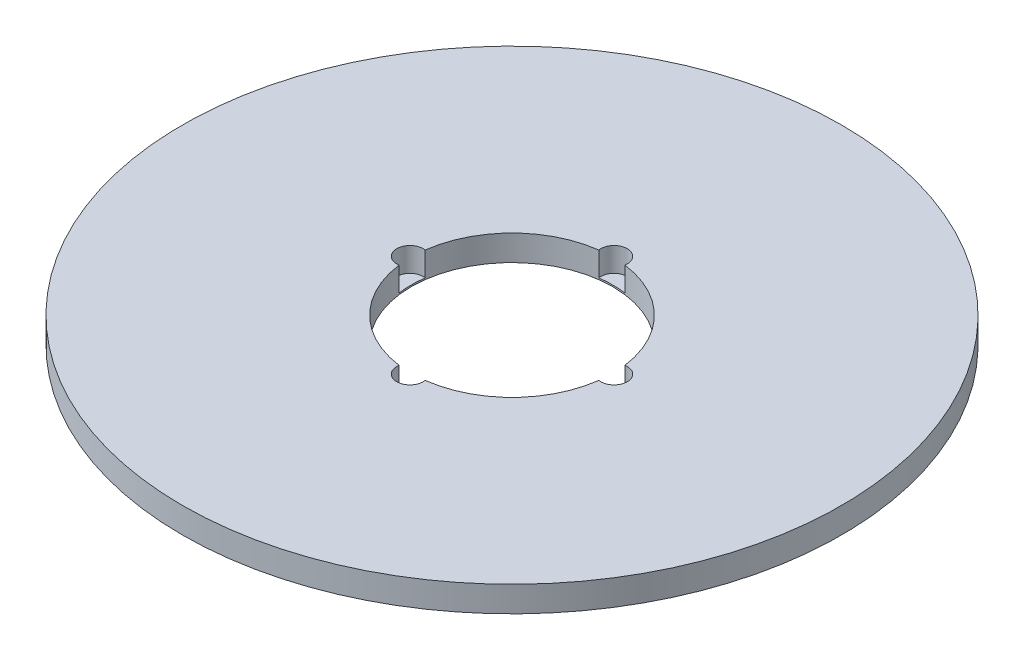
ISO-10303-21;
HEADER;
FILE_DESCRIPTION(('STEP AP214'),'2;1');
FILE_NAME('part.step','',(''),(''),'','','');
FILE_SCHEMA(('AUTOMOTIVE_DESIGN { 1 0 10303 214 1 1 1 1 }'));
ENDSEC;
DATA;
#1=APPLICATION_CONTEXT('core data for automotive mechanical design processes');
#2=APPLICATION_PROTOCOL_DEFINITION('international standard','automotive_design',2000,#1);
#3=PRODUCT_CONTEXT('',#1,'mechanical');
#4=PRODUCT('Part','Part','',(#3));
#5=PRODUCT_RELATED_PRODUCT_CATEGORY('part','',(#4));
#6=PRODUCT_DEFINITION_FORMATION('','',#4);
#7=PRODUCT_DEFINITION_CONTEXT('part definition',#1,'design');
#8=PRODUCT_DEFINITION('design','',#6,#7);
#9=PRODUCT_DEFINITION_SHAPE('','',#8);
#10=(LENGTH_UNIT() NAMED_UNIT(*) SI_UNIT(.MILLI.,.METRE.));
#11=(NAMED_UNIT(*) PLANE_ANGLE_UNIT() SI_UNIT($,.RADIAN.));
#12=(NAMED_UNIT(*) SI_UNIT($,.STERADIAN.) SOLID_ANGLE_UNIT());
#13=UNCERTAINTY_MEASURE_WITH_UNIT(LENGTH_MEASURE(1.E-05),#10,'distance_accuracy_value','');
#14=(GEOMETRIC_REPRESENTATION_CONTEXT(3) GLOBAL_UNCERTAINTY_ASSIGNED_CONTEXT((#13)) GLOBAL_UNIT_ASSIGNED_CONTEXT((#10,
#11,#12)) REPRESENTATION_CONTEXT('',''));
#15=CARTESIAN_POINT('',(0.,0.,0.));
#16=DIRECTION('',(0.,0.,1.));
#17=DIRECTION('',(1.,0.,0.));
#18=AXIS2_PLACEMENT_3D('',#15,#16,#17);
#19=CARTESIAN_POINT('',(0.,7.,0.));
#20=DIRECTION('',(0.,-1.,0.));
#21=DIRECTION('',(0.,0.,-1.));
#22=AXIS2_PLACEMENT_3D('',#19,#20,#21);
#23=CYLINDRICAL_SURFACE('',#22,90.);
#24=CARTESIAN_POINT('',(0.,7.,0.));
#25=DIRECTION('',(0.,1.,0.));
#26=DIRECTION('',(0.,0.,1.));
#27=AXIS2_PLACEMENT_3D('',#24,#25,#26);
#28=CIRCLE('',#27,90.);
#29=CARTESIAN_POINT('',(0.,7.,90.));
#30=VERTEX_POINT('',#29);
#31=EDGE_CURVE('E145',#30,#30,#28,.T.);
#32=ORIENTED_EDGE('',*,*,#31,.F.);
#33=EDGE_LOOP('',(#32));
#34=FACE_BOUND('',#33,.T.);
#35=CARTESIAN_POINT('',(0.,0.,0.));
#36=DIRECTION('',(0.,1.,0.));
#37=DIRECTION('',(0.,0.,1.));
#38=AXIS2_PLACEMENT_3D('',#35,#36,#37);
#39=CIRCLE('',#38,90.);
#40=CARTESIAN_POINT('',(0.,0.,90.));
#41=VERTEX_POINT('',#40);
#42=EDGE_CURVE('E143',#41,#41,#39,.T.);
#43=ORIENTED_EDGE('',*,*,#42,.T.);
#44=EDGE_LOOP('',(#43));
#45=FACE_BOUND('',#44,.T.);
#46=ADVANCED_FACE('F39',(#34,#45),#23,.T.);
#47=CARTESIAN_POINT('',(0.,7.,0.));
#48=DIRECTION('',(0.,1.,0.));
#49=DIRECTION('',(0.,0.,1.));
#50=AXIS2_PLACEMENT_3D('',#47,#48,#49);
#51=PLANE('',#50);
#52=CARTESIAN_POINT('',(0.,7.,27.861501837331));
#53=DIRECTION('',(0.,1.,0.));
#54=DIRECTION('',(1.,0.,0.));
#55=AXIS2_PLACEMENT_3D('',#52,#53,#54);
#56=CIRCLE('',#55,3.61404481354777);
#57=CARTESIAN_POINT('',(-3.56497036682153,7.,27.267947966132));
#58=VERTEX_POINT('',#57);
#59=CARTESIAN_POINT('',(3.56497036682172,7.,27.267947966132));
#60=VERTEX_POINT('',#59);
#61=EDGE_CURVE('E152',#58,#60,#56,.T.);
#62=ORIENTED_EDGE('',*,*,#61,.F.);
#63=CARTESIAN_POINT('',(0.,7.,0.));
#64=DIRECTION('',(0.,1.,0.));
#65=DIRECTION('',(0.,0.,1.));
#66=AXIS2_PLACEMENT_3D('',#63,#64,#65);
#67=CIRCLE('',#66,27.5);
#68=CARTESIAN_POINT('',(-27.267947966132,7.,3.56497036682162));
#69=VERTEX_POINT('',#68);
#70=EDGE_CURVE('E133',#69,#58,#67,.T.);
#71=ORIENTED_EDGE('',*,*,#70,.F.);
#72=CARTESIAN_POINT('',(-27.861501837331,7.,0.));
#73=DIRECTION('',(0.,1.,0.));
#74=DIRECTION('',(0.,0.,1.));
#75=AXIS2_PLACEMENT_3D('',#72,#73,#74);
#76=CIRCLE('',#75,3.61404481354777);
#77=CARTESIAN_POINT('',(-27.267947966132,7.,-3.56497036682162));
#78=VERTEX_POINT('',#77);
#79=EDGE_CURVE('E128',#78,#69,#76,.T.);
#80=ORIENTED_EDGE('',*,*,#79,.F.);
#81=CARTESIAN_POINT('',(-3.56497036682191,7.,-27.267947966132));
#82=VERTEX_POINT('',#81);
#83=EDGE_CURVE('E121',#82,#78,#67,.T.);
#84=ORIENTED_EDGE('',*,*,#83,.F.);
#85=CARTESIAN_POINT('',(-2.91833741211554E-13,7.,-27.861501837331));
#86=DIRECTION('',(0.,1.,0.));
#87=DIRECTION('',(-1.,0.,0.));
#88=AXIS2_PLACEMENT_3D('',#85,#86,#87);
#89=CIRCLE('',#88,3.61404481354777);
#90=CARTESIAN_POINT('',(3.56497036682134,7.,-27.2679479661321));
#91=VERTEX_POINT('',#90);
#92=EDGE_CURVE('E105',#91,#82,#89,.T.);
#93=ORIENTED_EDGE('',*,*,#92,.F.);
#94=CARTESIAN_POINT('',(27.267947966132,7.,-3.56497036682162));
#95=VERTEX_POINT('',#94);
#96=EDGE_CURVE('E131',#95,#91,#67,.T.);
#97=ORIENTED_EDGE('',*,*,#96,.F.);
#98=CARTESIAN_POINT('',(27.861501837331,7.,0.));
#99=DIRECTION('',(0.,1.,0.));
#100=DIRECTION('',(0.,0.,-1.));
#101=AXIS2_PLACEMENT_3D('',#98,#99,#100);
#102=CIRCLE('',#101,3.61404481354777);
#103=CARTESIAN_POINT('',(27.267947966132,7.,3.56497036682162));
#104=VERTEX_POINT('',#103);
#105=EDGE_CURVE('E154',#104,#95,#102,.T.);
#106=ORIENTED_EDGE('',*,*,#105,.F.);
#107=EDGE_CURVE('E134',#60,#104,#67,.T.);
#108=ORIENTED_EDGE('',*,*,#107,.F.);
#109=EDGE_LOOP('',(#62,#71,#80,#84,#93,#97,#106,#108));
#110=FACE_BOUND('',#109,.T.);
#111=ORIENTED_EDGE('',*,*,#31,.T.);
#112=EDGE_LOOP('',(#111));
#113=FACE_BOUND('',#112,.T.);
#114=ADVANCED_FACE('F130',(#110,#113),#51,.T.);
#115=CARTESIAN_POINT('',(0.,0.,0.));
#116=DIRECTION('',(0.,1.,0.));
#117=DIRECTION('',(0.,0.,1.));
#118=AXIS2_PLACEMENT_3D('',#115,#116,#117);
#119=PLANE('',#118);
#120=CARTESIAN_POINT('',(0.,0.,0.));
#121=DIRECTION('',(0.,1.,0.));
#122=DIRECTION('',(0.,0.,1.));
#123=AXIS2_PLACEMENT_3D('',#120,#121,#122);
#124=CIRCLE('',#123,27.5);
#125=CARTESIAN_POINT('',(0.,0.,27.5));
#126=VERTEX_POINT('',#125);
#127=EDGE_CURVE('E135',#126,#126,#124,.T.);
#128=ORIENTED_EDGE('',*,*,#127,.T.);
#129=EDGE_LOOP('',(#128));
#130=FACE_BOUND('',#129,.T.);
#131=ORIENTED_EDGE('',*,*,#42,.F.);
#132=EDGE_LOOP('',(#131));
#133=FACE_BOUND('',#132,.T.);
#134=ADVANCED_FACE('F195',(#130,#133),#119,.F.);
#135=CARTESIAN_POINT('',(0.,7.,0.));
#136=DIRECTION('',(0.,-1.,0.));
#137=DIRECTION('',(0.,0.,-1.));
#138=AXIS2_PLACEMENT_3D('',#135,#136,#137);
#139=CYLINDRICAL_SURFACE('',#138,27.5);
#140=DIRECTION('',(0.,1.,0.));
#141=VECTOR('',#140,1.);
#142=CARTESIAN_POINT('',(-3.56497036682153,3.70786376443623,27.267947966132));
#143=LINE('',#142,#141);
#144=CARTESIAN_POINT('',(-3.56497036682153,0.415727528872471,27.267947966132));
#145=VERTEX_POINT('',#144);
#146=EDGE_CURVE('E11',#145,#58,#143,.T.);
#147=ORIENTED_EDGE('',*,*,#146,.F.);
#148=CARTESIAN_POINT('',(0.,0.415727528872471,0.));
#149=DIRECTION('',(0.,1.,0.));
#150=DIRECTION('',(0.,0.,1.));
#151=AXIS2_PLACEMENT_3D('',#148,#149,#150);
#152=CIRCLE('',#151,27.5);
#153=CARTESIAN_POINT('',(3.56497036682172,0.415727528872471,27.267947966132));
#154=VERTEX_POINT('',#153);
#155=EDGE_CURVE('E169',#145,#154,#152,.T.);
#156=ORIENTED_EDGE('',*,*,#155,.T.);
#157=DIRECTION('',(0.,1.,0.));
#158=VECTOR('',#157,1.);
#159=CARTESIAN_POINT('',(3.56497036682172,3.70786376443623,27.267947966132));
#160=LINE('',#159,#158);
#161=EDGE_CURVE('E46',#60,#154,#160,.F.);
#162=ORIENTED_EDGE('',*,*,#161,.F.);
#163=ORIENTED_EDGE('',*,*,#107,.T.);
#164=DIRECTION('',(0.,1.,0.));
#165=VECTOR('',#164,1.);
#166=CARTESIAN_POINT('',(27.267947966132,3.70786376443623,3.56497036682162));
#167=LINE('',#166,#165);
#168=CARTESIAN_POINT('',(27.267947966132,0.415727528872471,3.56497036682162));
#169=VERTEX_POINT('',#168);
#170=EDGE_CURVE('E151',#169,#104,#167,.T.);
#171=ORIENTED_EDGE('',*,*,#170,.F.);
#172=CARTESIAN_POINT('',(0.,0.415727528872471,0.));
#173=DIRECTION('',(0.,1.,0.));
#174=DIRECTION('',(0.,0.,1.));
#175=AXIS2_PLACEMENT_3D('',#172,#173,#174);
#176=CIRCLE('',#175,27.5);
#177=CARTESIAN_POINT('',(27.267947966132,0.415727528872471,-3.56497036682162));
#178=VERTEX_POINT('',#177);
#179=EDGE_CURVE('E173',#169,#178,#176,.T.);
#180=ORIENTED_EDGE('',*,*,#179,.T.);
#181=DIRECTION('',(0.,1.,0.));
#182=VECTOR('',#181,1.);
#183=CARTESIAN_POINT('',(27.267947966132,3.70786376443623,-3.56497036682162));
#184=LINE('',#183,#182);
#185=EDGE_CURVE('E168',#95,#178,#184,.F.);
#186=ORIENTED_EDGE('',*,*,#185,.F.);
#187=ORIENTED_EDGE('',*,*,#96,.T.);
#188=DIRECTION('',(0.,1.,0.));
#189=VECTOR('',#188,1.);
#190=CARTESIAN_POINT('',(3.56497036682134,3.70786376443623,-27.2679479661321));
#191=LINE('',#190,#189);
#192=CARTESIAN_POINT('',(3.56497036682134,0.415727528872471,-27.2679479661321));
#193=VERTEX_POINT('',#192);
#194=EDGE_CURVE('E108',#193,#91,#191,.T.);
#195=ORIENTED_EDGE('',*,*,#194,.F.);
#196=CARTESIAN_POINT('',(0.,0.415727528872471,0.));
#197=DIRECTION('',(0.,1.,0.));
#198=DIRECTION('',(0.,0.,1.));
#199=AXIS2_PLACEMENT_3D('',#196,#197,#198);
#200=CIRCLE('',#199,27.5);
#201=CARTESIAN_POINT('',(-3.56497036682191,0.415727528872471,-27.267947966132));
#202=VERTEX_POINT('',#201);
#203=EDGE_CURVE('E122',#193,#202,#200,.T.);
#204=ORIENTED_EDGE('',*,*,#203,.T.);
#205=DIRECTION('',(0.,1.,0.));
#206=VECTOR('',#205,1.);
#207=CARTESIAN_POINT('',(-3.56497036682191,3.70786376443623,-27.267947966132));
#208=LINE('',#207,#206);
#209=EDGE_CURVE('E106',#82,#202,#208,.F.);
#210=ORIENTED_EDGE('',*,*,#209,.F.);
#211=ORIENTED_EDGE('',*,*,#83,.T.);
#212=DIRECTION('',(0.,1.,0.));
#213=VECTOR('',#212,1.);
#214=CARTESIAN_POINT('',(-27.267947966132,3.70786376443623,-3.56497036682162));
#215=LINE('',#214,#213);
#216=CARTESIAN_POINT('',(-27.267947966132,0.415727528872471,-3.56497036682162));
#217=VERTEX_POINT('',#216);
#218=EDGE_CURVE('E177',#217,#78,#215,.T.);
#219=ORIENTED_EDGE('',*,*,#218,.F.);
#220=CARTESIAN_POINT('',(0.,0.415727528872471,0.));
#221=DIRECTION('',(0.,1.,0.));
#222=DIRECTION('',(0.,0.,1.));
#223=AXIS2_PLACEMENT_3D('',#220,#221,#222);
#224=CIRCLE('',#223,27.5);
#225=CARTESIAN_POINT('',(-27.267947966132,0.415727528872471,3.56497036682162));
#226=VERTEX_POINT('',#225);
#227=EDGE_CURVE('E185',#217,#226,#224,.T.);
#228=ORIENTED_EDGE('',*,*,#227,.T.);
#229=DIRECTION('',(0.,1.,0.));
#230=VECTOR('',#229,1.);
#231=CARTESIAN_POINT('',(-27.267947966132,3.70786376443623,3.56497036682162));
#232=LINE('',#231,#230);
#233=EDGE_CURVE('E179',#69,#226,#232,.F.);
#234=ORIENTED_EDGE('',*,*,#233,.F.);
#235=ORIENTED_EDGE('',*,*,#70,.T.);
#236=EDGE_LOOP('',(#147,#156,#162,#163,#171,#180,#186,#187,#195,#204,#210,#211,#219,#228,#234,#235));
#237=FACE_BOUND('',#236,.T.);
#238=ORIENTED_EDGE('',*,*,#127,.F.);
#239=EDGE_LOOP('',(#238));
#240=FACE_BOUND('',#239,.T.);
#241=ADVANCED_FACE('F117',(#237,#240),#139,.F.);
#242=CARTESIAN_POINT('',(-27.861501837331,0.415727528872471,0.));
#243=DIRECTION('',(0.,1.,0.));
#244=DIRECTION('',(0.,0.,1.));
#245=AXIS2_PLACEMENT_3D('',#242,#243,#244);
#246=CYLINDRICAL_SURFACE('',#245,3.61404481354777);
#247=ORIENTED_EDGE('',*,*,#218,.T.);
#248=ORIENTED_EDGE('',*,*,#79,.T.);
#249=ORIENTED_EDGE('',*,*,#233,.T.);
#250=CARTESIAN_POINT('',(-27.861501837331,0.415727528872471,0.));
#251=DIRECTION('',(0.,1.,0.));
#252=DIRECTION('',(0.,0.,1.));
#253=AXIS2_PLACEMENT_3D('',#250,#251,#252);
#254=CIRCLE('',#253,3.61404481354777);
#255=EDGE_CURVE('E140',#217,#226,#254,.T.);
#256=ORIENTED_EDGE('',*,*,#255,.F.);
#257=EDGE_LOOP('',(#247,#248,#249,#256));
#258=FACE_BOUND('',#257,.T.);
#259=ADVANCED_FACE('F200',(#258),#246,.F.);
#260=CARTESIAN_POINT('',(-27.861501837331,0.415727528872471,0.));
#261=DIRECTION('',(0.,1.,0.));
#262=DIRECTION('',(0.,0.,1.));
#263=AXIS2_PLACEMENT_3D('',#260,#261,#262);
#264=PLANE('',#263);
#265=ORIENTED_EDGE('',*,*,#255,.T.);
#266=ORIENTED_EDGE('',*,*,#227,.F.);
#267=EDGE_LOOP('',(#265,#266));
#268=FACE_BOUND('',#267,.T.);
#269=ADVANCED_FACE('F202',(#268),#264,.T.);
#270=CARTESIAN_POINT('',(-2.91833741211554E-13,0.415727528872471,-27.861501837331));
#271=DIRECTION('',(0.,1.,0.));
#272=DIRECTION('',(0.,0.,1.));
#273=AXIS2_PLACEMENT_3D('',#270,#271,#272);
#274=CYLINDRICAL_SURFACE('',#273,3.61404481354777);
#275=ORIENTED_EDGE('',*,*,#194,.T.);
#276=ORIENTED_EDGE('',*,*,#92,.T.);
#277=ORIENTED_EDGE('',*,*,#209,.T.);
#278=CARTESIAN_POINT('',(-2.91833741211554E-13,0.415727528872471,-27.861501837331));
#279=DIRECTION('',(0.,1.,0.));
#280=DIRECTION('',(-1.,0.,0.));
#281=AXIS2_PLACEMENT_3D('',#278,#279,#280);
#282=CIRCLE('',#281,3.61404481354777);
#283=EDGE_CURVE('E111',#193,#202,#282,.T.);
#284=ORIENTED_EDGE('',*,*,#283,.F.);
#285=EDGE_LOOP('',(#275,#276,#277,#284));
#286=FACE_BOUND('',#285,.T.);
#287=ADVANCED_FACE('F102',(#286),#274,.F.);
#288=CARTESIAN_POINT('',(-2.91833741211554E-13,0.415727528872471,-27.861501837331));
#289=DIRECTION('',(0.,1.,0.));
#290=DIRECTION('',(-1.,0.,0.));
#291=AXIS2_PLACEMENT_3D('',#288,#289,#290);
#292=PLANE('',#291);
#293=ORIENTED_EDGE('',*,*,#283,.T.);
#294=ORIENTED_EDGE('',*,*,#203,.F.);
#295=EDGE_LOOP('',(#293,#294));
#296=FACE_BOUND('',#295,.T.);
#297=ADVANCED_FACE('F211',(#296),#292,.T.);
#298=CARTESIAN_POINT('',(27.861501837331,0.415727528872471,0.));
#299=DIRECTION('',(0.,1.,0.));
#300=DIRECTION('',(0.,0.,1.));
#301=AXIS2_PLACEMENT_3D('',#298,#299,#300);
#302=CYLINDRICAL_SURFACE('',#301,3.61404481354777);
#303=ORIENTED_EDGE('',*,*,#170,.T.);
#304=ORIENTED_EDGE('',*,*,#105,.T.);
#305=ORIENTED_EDGE('',*,*,#185,.T.);
#306=CARTESIAN_POINT('',(27.861501837331,0.415727528872471,0.));
#307=DIRECTION('',(0.,1.,0.));
#308=DIRECTION('',(0.,0.,-1.));
#309=AXIS2_PLACEMENT_3D('',#306,#307,#308);
#310=CIRCLE('',#309,3.61404481354777);
#311=EDGE_CURVE('E56',#169,#178,#310,.T.);
#312=ORIENTED_EDGE('',*,*,#311,.F.);
#313=EDGE_LOOP('',(#303,#304,#305,#312));
#314=FACE_BOUND('',#313,.T.);
#315=ADVANCED_FACE('F212',(#314),#302,.F.);
#316=CARTESIAN_POINT('',(27.861501837331,0.415727528872471,0.));
#317=DIRECTION('',(0.,1.,0.));
#318=DIRECTION('',(0.,0.,-1.));
#319=AXIS2_PLACEMENT_3D('',#316,#317,#318);
#320=PLANE('',#319);
#321=ORIENTED_EDGE('',*,*,#311,.T.);
#322=ORIENTED_EDGE('',*,*,#179,.F.);
#323=EDGE_LOOP('',(#321,#322));
#324=FACE_BOUND('',#323,.T.);
#325=ADVANCED_FACE('F217',(#324),#320,.T.);
#326=CARTESIAN_POINT('',(0.,0.415727528872471,27.861501837331));
#327=DIRECTION('',(0.,1.,0.));
#328=DIRECTION('',(0.,0.,1.));
#329=AXIS2_PLACEMENT_3D('',#326,#327,#328);
#330=CYLINDRICAL_SURFACE('',#329,3.61404481354777);
#331=ORIENTED_EDGE('',*,*,#146,.T.);
#332=ORIENTED_EDGE('',*,*,#61,.T.);
#333=ORIENTED_EDGE('',*,*,#161,.T.);
#334=CARTESIAN_POINT('',(0.,0.415727528872471,27.861501837331));
#335=DIRECTION('',(0.,1.,0.));
#336=DIRECTION('',(1.,0.,0.));
#337=AXIS2_PLACEMENT_3D('',#334,#335,#336);
#338=CIRCLE('',#337,3.61404481354777);
#339=EDGE_CURVE('E55',#145,#154,#338,.T.);
#340=ORIENTED_EDGE('',*,*,#339,.F.);
#341=EDGE_LOOP('',(#331,#332,#333,#340));
#342=FACE_BOUND('',#341,.T.);
#343=ADVANCED_FACE('F170',(#342),#330,.F.);
#344=CARTESIAN_POINT('',(0.,0.415727528872471,27.861501837331));
#345=DIRECTION('',(0.,1.,0.));
#346=DIRECTION('',(1.,0.,0.));
#347=AXIS2_PLACEMENT_3D('',#344,#345,#346);
#348=PLANE('',#347);
#349=ORIENTED_EDGE('',*,*,#339,.T.);
#350=ORIENTED_EDGE('',*,*,#155,.F.);
#351=EDGE_LOOP('',(#349,#350));
#352=FACE_BOUND('',#351,.T.);
#353=ADVANCED_FACE('F224',(#352),#348,.T.);
#354=CLOSED_SHELL('',(#46,#114,#134,#241,#259,#269,#287,#297,#315,#325,#343,#353));
#355=MANIFOLD_SOLID_BREP('B2',#354);
#356=ADVANCED_BREP_SHAPE_REPRESENTATION('',(#18,#355),#14);
#357=SHAPE_DEFINITION_REPRESENTATION(#9,#356);
ENDSEC;
END-ISO-10303-21;
